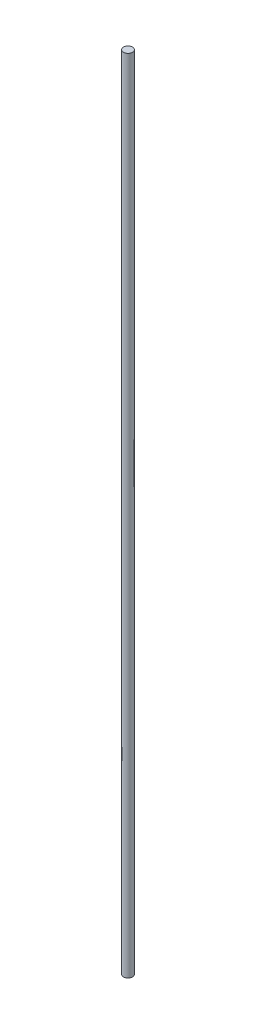
ISO-10303-21;
HEADER;
FILE_DESCRIPTION(('STEP AP214'),'2;1');
FILE_NAME('part.step','',(''),(''),'','','');
FILE_SCHEMA(('AUTOMOTIVE_DESIGN { 1 0 10303 214 1 1 1 1 }'));
ENDSEC;
DATA;
#1=APPLICATION_CONTEXT('core data for automotive mechanical design processes');
#2=APPLICATION_PROTOCOL_DEFINITION('international standard','automotive_design',2000,#1);
#3=PRODUCT_CONTEXT('',#1,'mechanical');
#4=PRODUCT('Part','Part','',(#3));
#5=PRODUCT_RELATED_PRODUCT_CATEGORY('part','',(#4));
#6=PRODUCT_DEFINITION_FORMATION('','',#4);
#7=PRODUCT_DEFINITION_CONTEXT('part definition',#1,'design');
#8=PRODUCT_DEFINITION('design','',#6,#7);
#9=PRODUCT_DEFINITION_SHAPE('','',#8);
#10=(LENGTH_UNIT() NAMED_UNIT(*) SI_UNIT(.MILLI.,.METRE.));
#11=(NAMED_UNIT(*) PLANE_ANGLE_UNIT() SI_UNIT($,.RADIAN.));
#12=(NAMED_UNIT(*) SI_UNIT($,.STERADIAN.) SOLID_ANGLE_UNIT());
#13=UNCERTAINTY_MEASURE_WITH_UNIT(LENGTH_MEASURE(1.E-05),#10,'distance_accuracy_value','');
#14=(GEOMETRIC_REPRESENTATION_CONTEXT(3) GLOBAL_UNCERTAINTY_ASSIGNED_CONTEXT((#13)) GLOBAL_UNIT_ASSIGNED_CONTEXT((#10,
#11,#12)) REPRESENTATION_CONTEXT('',''));
#15=CARTESIAN_POINT('',(0.,0.,0.));
#16=DIRECTION('',(0.,0.,1.));
#17=DIRECTION('',(1.,0.,0.));
#18=AXIS2_PLACEMENT_3D('',#15,#16,#17);
#19=CARTESIAN_POINT('',(0.,901.7,0.));
#20=DIRECTION('',(0.,-1.,0.));
#21=DIRECTION('',(0.,0.,-1.));
#22=AXIS2_PLACEMENT_3D('',#19,#20,#21);
#23=CYLINDRICAL_SURFACE('',#22,5.08);
#24=CARTESIAN_POINT('',(0.,901.7,0.));
#25=DIRECTION('',(0.,1.,0.));
#26=DIRECTION('',(0.,0.,1.));
#27=AXIS2_PLACEMENT_3D('',#24,#25,#26);
#28=CIRCLE('',#27,5.08);
#29=CARTESIAN_POINT('',(0.,901.7,5.08));
#30=VERTEX_POINT('',#29);
#31=EDGE_CURVE('E10',#30,#30,#28,.T.);
#32=ORIENTED_EDGE('',*,*,#31,.F.);
#33=EDGE_LOOP('',(#32));
#34=FACE_BOUND('',#33,.T.);
#35=CARTESIAN_POINT('',(0.,0.,0.));
#36=DIRECTION('',(0.,1.,0.));
#37=DIRECTION('',(0.,0.,1.));
#38=AXIS2_PLACEMENT_3D('',#35,#36,#37);
#39=CIRCLE('',#38,5.08);
#40=CARTESIAN_POINT('',(0.,0.,5.08));
#41=VERTEX_POINT('',#40);
#42=EDGE_CURVE('E37',#41,#41,#39,.T.);
#43=ORIENTED_EDGE('',*,*,#42,.T.);
#44=EDGE_LOOP('',(#43));
#45=FACE_BOUND('',#44,.T.);
#46=ADVANCED_FACE('F34',(#34,#45),#23,.T.);
#47=CARTESIAN_POINT('',(0.,901.7,0.));
#48=DIRECTION('',(0.,1.,0.));
#49=DIRECTION('',(0.,0.,1.));
#50=AXIS2_PLACEMENT_3D('',#47,#48,#49);
#51=PLANE('',#50);
#52=ORIENTED_EDGE('',*,*,#31,.T.);
#53=EDGE_LOOP('',(#52));
#54=FACE_BOUND('',#53,.T.);
#55=ADVANCED_FACE('F49',(#54),#51,.T.);
#56=CARTESIAN_POINT('',(0.,0.,0.));
#57=DIRECTION('',(0.,1.,0.));
#58=DIRECTION('',(0.,0.,1.));
#59=AXIS2_PLACEMENT_3D('',#56,#57,#58);
#60=PLANE('',#59);
#61=ORIENTED_EDGE('',*,*,#42,.F.);
#62=EDGE_LOOP('',(#61));
#63=FACE_BOUND('',#62,.T.);
#64=ADVANCED_FACE('F47',(#63),#60,.F.);
#65=CLOSED_SHELL('',(#46,#55,#64));
#66=MANIFOLD_SOLID_BREP('B2',#65);
#67=ADVANCED_BREP_SHAPE_REPRESENTATION('',(#18,#66),#14);
#68=SHAPE_DEFINITION_REPRESENTATION(#9,#67);
ENDSEC;
END-ISO-10303-21;
